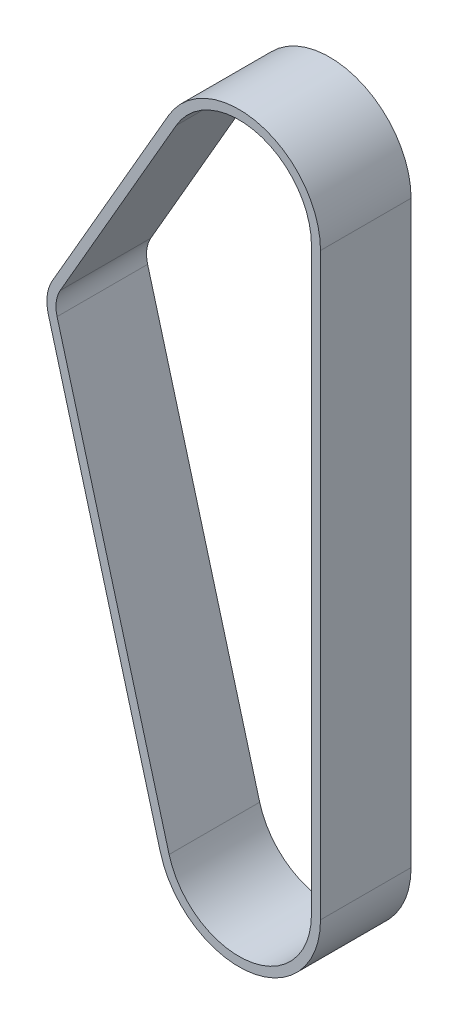
ISO-10303-21;
HEADER;
FILE_DESCRIPTION(('STEP AP214'),'2;1');
FILE_NAME('part.step','',(''),(''),'','','');
FILE_SCHEMA(('AUTOMOTIVE_DESIGN { 1 0 10303 214 1 1 1 1 }'));
ENDSEC;
DATA;
#1=APPLICATION_CONTEXT('core data for automotive mechanical design processes');
#2=APPLICATION_PROTOCOL_DEFINITION('international standard','automotive_design',2000,#1);
#3=PRODUCT_CONTEXT('',#1,'mechanical');
#4=PRODUCT('Part','Part','',(#3));
#5=PRODUCT_RELATED_PRODUCT_CATEGORY('part','',(#4));
#6=PRODUCT_DEFINITION_FORMATION('','',#4);
#7=PRODUCT_DEFINITION_CONTEXT('part definition',#1,'design');
#8=PRODUCT_DEFINITION('design','',#6,#7);
#9=PRODUCT_DEFINITION_SHAPE('','',#8);
#10=(LENGTH_UNIT() NAMED_UNIT(*) SI_UNIT(.MILLI.,.METRE.));
#11=(NAMED_UNIT(*) PLANE_ANGLE_UNIT() SI_UNIT($,.RADIAN.));
#12=(NAMED_UNIT(*) SI_UNIT($,.STERADIAN.) SOLID_ANGLE_UNIT());
#13=UNCERTAINTY_MEASURE_WITH_UNIT(LENGTH_MEASURE(1.E-05),#10,'distance_accuracy_value','');
#14=(GEOMETRIC_REPRESENTATION_CONTEXT(3) GLOBAL_UNCERTAINTY_ASSIGNED_CONTEXT((#13)) GLOBAL_UNIT_ASSIGNED_CONTEXT((#10,
#11,#12)) REPRESENTATION_CONTEXT('',''));
#15=CARTESIAN_POINT('',(0.,0.,0.));
#16=DIRECTION('',(0.,0.,1.));
#17=DIRECTION('',(1.,0.,0.));
#18=AXIS2_PLACEMENT_3D('',#15,#16,#17);
#19=CARTESIAN_POINT('',(3.08780778723872E-13,319.999999999999,50.));
#20=DIRECTION('',(0.,0.,1.));
#21=DIRECTION('',(1.,0.,0.));
#22=AXIS2_PLACEMENT_3D('',#19,#20,#21);
#23=PLANE('',#22);
#24=CARTESIAN_POINT('',(3.08780778723872E-13,319.999999999999,50.));
#25=DIRECTION('',(0.,0.,1.));
#26=DIRECTION('',(1.,0.,0.));
#27=AXIS2_PLACEMENT_3D('',#24,#25,#26);
#28=CIRCLE('',#27,44.9999999999997);
#29=CARTESIAN_POINT('',(45.,319.999999999999,50.));
#30=VERTEX_POINT('',#29);
#31=CARTESIAN_POINT('',(-38.9711431702992,342.499999999999,50.));
#32=VERTEX_POINT('',#31);
#33=EDGE_CURVE('E181',#30,#32,#28,.T.);
#34=ORIENTED_EDGE('',*,*,#33,.T.);
#35=DIRECTION('',(-0.500000000000004,-0.866025403784437,0.));
#36=VECTOR('',#35,1.);
#37=CARTESIAN_POINT('',(-103.03557158515,231.53715502762,50.));
#38=LINE('',#37,#36);
#39=CARTESIAN_POINT('',(-103.03557158515,231.53715502762,50.));
#40=VERTEX_POINT('',#39);
#41=EDGE_CURVE('E184',#32,#40,#38,.T.);
#42=ORIENTED_EDGE('',*,*,#41,.T.);
#43=CARTESIAN_POINT('',(-83.55,220.28715502762,50.));
#44=DIRECTION('',(0.,0.,1.));
#45=DIRECTION('',(1.,0.,0.));
#46=AXIS2_PLACEMENT_3D('',#43,#44,#45);
#47=CIRCLE('',#46,22.5);
#48=CARTESIAN_POINT('',(-105.253530727052,214.353627073703,50.));
#49=VERTEX_POINT('',#48);
#50=EDGE_CURVE('E187',#40,#49,#47,.T.);
#51=ORIENTED_EDGE('',*,*,#50,.T.);
#52=DIRECTION('',(0.263712353507414,-0.964601365646753,0.));
#53=VECTOR('',#52,1.);
#54=CARTESIAN_POINT('',(-105.253530727052,214.353627073703,50.));
#55=LINE('',#54,#53);
#56=CARTESIAN_POINT('',(-43.4070614541039,-11.8670559078336,50.));
#57=VERTEX_POINT('',#56);
#58=EDGE_CURVE('E189',#49,#57,#55,.T.);
#59=ORIENTED_EDGE('',*,*,#58,.T.);
#60=CARTESIAN_POINT('',(0.,0.,50.));
#61=DIRECTION('',(0.,0.,1.));
#62=DIRECTION('',(1.,0.,0.));
#63=AXIS2_PLACEMENT_3D('',#60,#61,#62);
#64=CIRCLE('',#63,45.);
#65=CARTESIAN_POINT('',(45.,0.,50.));
#66=VERTEX_POINT('',#65);
#67=EDGE_CURVE('E191',#57,#66,#64,.T.);
#68=ORIENTED_EDGE('',*,*,#67,.T.);
#69=DIRECTION('',(0.,1.,0.));
#70=VECTOR('',#69,1.);
#71=CARTESIAN_POINT('',(45.,319.999999999999,50.));
#72=LINE('',#71,#70);
#73=EDGE_CURVE('E193',#66,#30,#72,.T.);
#74=ORIENTED_EDGE('',*,*,#73,.T.);
#75=EDGE_LOOP('',(#34,#42,#51,#59,#68,#74));
#76=FACE_BOUND('',#75,.T.);
#77=DIRECTION('',(0.,1.,0.));
#78=VECTOR('',#77,1.);
#79=CARTESIAN_POINT('',(40.,319.999999999999,50.));
#80=LINE('',#79,#78);
#81=CARTESIAN_POINT('',(40.,0.,50.));
#82=VERTEX_POINT('',#81);
#83=CARTESIAN_POINT('',(40.,319.999999999999,50.));
#84=VERTEX_POINT('',#83);
#85=EDGE_CURVE('E138',#82,#84,#80,.T.);
#86=ORIENTED_EDGE('',*,*,#85,.F.);
#87=CARTESIAN_POINT('',(0.,0.,50.));
#88=DIRECTION('',(0.,0.,1.));
#89=DIRECTION('',(1.,0.,0.));
#90=AXIS2_PLACEMENT_3D('',#87,#88,#89);
#91=CIRCLE('',#90,40.);
#92=CARTESIAN_POINT('',(-38.5840546258701,-10.5484941402966,50.));
#93=VERTEX_POINT('',#92);
#94=EDGE_CURVE('E130',#93,#82,#91,.T.);
#95=ORIENTED_EDGE('',*,*,#94,.F.);
#96=DIRECTION('',(0.263712353507414,-0.964601365646753,0.));
#97=VECTOR('',#96,1.);
#98=CARTESIAN_POINT('',(-100.430523898818,215.67218884124,50.));
#99=LINE('',#98,#97);
#100=CARTESIAN_POINT('',(-100.430523898818,215.67218884124,50.));
#101=VERTEX_POINT('',#100);
#102=EDGE_CURVE('E159',#101,#93,#99,.T.);
#103=ORIENTED_EDGE('',*,*,#102,.F.);
#104=CARTESIAN_POINT('',(-83.55,220.28715502762,50.));
#105=DIRECTION('',(0.,0.,1.));
#106=DIRECTION('',(1.,0.,0.));
#107=AXIS2_PLACEMENT_3D('',#104,#105,#106);
#108=CIRCLE('',#107,17.5);
#109=CARTESIAN_POINT('',(-98.7054445662277,229.03715502762,50.));
#110=VERTEX_POINT('',#109);
#111=EDGE_CURVE('E157',#110,#101,#108,.T.);
#112=ORIENTED_EDGE('',*,*,#111,.F.);
#113=DIRECTION('',(-0.500000000000004,-0.866025403784437,0.));
#114=VECTOR('',#113,1.);
#115=CARTESIAN_POINT('',(-98.7054445662277,229.03715502762,50.));
#116=LINE('',#115,#114);
#117=CARTESIAN_POINT('',(-34.641016151377,339.999999999999,50.));
#118=VERTEX_POINT('',#117);
#119=EDGE_CURVE('E153',#118,#110,#116,.T.);
#120=ORIENTED_EDGE('',*,*,#119,.F.);
#121=CARTESIAN_POINT('',(3.08780778723872E-13,319.999999999999,50.));
#122=DIRECTION('',(0.,0.,1.));
#123=DIRECTION('',(1.,0.,0.));
#124=AXIS2_PLACEMENT_3D('',#121,#122,#123);
#125=CIRCLE('',#124,39.9999999999997);
#126=EDGE_CURVE('E151',#84,#118,#125,.T.);
#127=ORIENTED_EDGE('',*,*,#126,.F.);
#128=EDGE_LOOP('',(#86,#95,#103,#112,#120,#127));
#129=FACE_BOUND('',#128,.T.);
#130=ADVANCED_FACE('F41',(#76,#129),#23,.T.);
#131=CARTESIAN_POINT('',(3.08780778723872E-13,319.999999999999,0.));
#132=DIRECTION('',(0.,0.,1.));
#133=DIRECTION('',(1.,0.,0.));
#134=AXIS2_PLACEMENT_3D('',#131,#132,#133);
#135=PLANE('',#134);
#136=CARTESIAN_POINT('',(3.08780778723872E-13,319.999999999999,0.));
#137=DIRECTION('',(0.,0.,1.));
#138=DIRECTION('',(1.,0.,0.));
#139=AXIS2_PLACEMENT_3D('',#136,#137,#138);
#140=CIRCLE('',#139,44.9999999999997);
#141=CARTESIAN_POINT('',(45.,319.999999999999,0.));
#142=VERTEX_POINT('',#141);
#143=CARTESIAN_POINT('',(-38.9711431702992,342.499999999999,0.));
#144=VERTEX_POINT('',#143);
#145=EDGE_CURVE('E146',#142,#144,#140,.T.);
#146=ORIENTED_EDGE('',*,*,#145,.F.);
#147=DIRECTION('',(0.,1.,0.));
#148=VECTOR('',#147,1.);
#149=CARTESIAN_POINT('',(45.,319.999999999999,0.));
#150=LINE('',#149,#148);
#151=CARTESIAN_POINT('',(45.,0.,0.));
#152=VERTEX_POINT('',#151);
#153=EDGE_CURVE('E185',#152,#142,#150,.T.);
#154=ORIENTED_EDGE('',*,*,#153,.F.);
#155=CARTESIAN_POINT('',(0.,0.,0.));
#156=DIRECTION('',(0.,0.,1.));
#157=DIRECTION('',(1.,0.,0.));
#158=AXIS2_PLACEMENT_3D('',#155,#156,#157);
#159=CIRCLE('',#158,45.);
#160=CARTESIAN_POINT('',(-43.4070614541039,-11.8670559078336,0.));
#161=VERTEX_POINT('',#160);
#162=EDGE_CURVE('E204',#161,#152,#159,.T.);
#163=ORIENTED_EDGE('',*,*,#162,.F.);
#164=DIRECTION('',(0.263712353507414,-0.964601365646753,0.));
#165=VECTOR('',#164,1.);
#166=CARTESIAN_POINT('',(-105.253530727052,214.353627073703,0.));
#167=LINE('',#166,#165);
#168=CARTESIAN_POINT('',(-105.253530727052,214.353627073703,0.));
#169=VERTEX_POINT('',#168);
#170=EDGE_CURVE('E202',#169,#161,#167,.T.);
#171=ORIENTED_EDGE('',*,*,#170,.F.);
#172=CARTESIAN_POINT('',(-83.55,220.28715502762,0.));
#173=DIRECTION('',(0.,0.,1.));
#174=DIRECTION('',(1.,0.,0.));
#175=AXIS2_PLACEMENT_3D('',#172,#173,#174);
#176=CIRCLE('',#175,22.5);
#177=CARTESIAN_POINT('',(-103.03557158515,231.53715502762,0.));
#178=VERTEX_POINT('',#177);
#179=EDGE_CURVE('E200',#178,#169,#176,.T.);
#180=ORIENTED_EDGE('',*,*,#179,.F.);
#181=DIRECTION('',(-0.500000000000004,-0.866025403784437,0.));
#182=VECTOR('',#181,1.);
#183=CARTESIAN_POINT('',(-103.03557158515,231.53715502762,0.));
#184=LINE('',#183,#182);
#185=EDGE_CURVE('E198',#144,#178,#184,.T.);
#186=ORIENTED_EDGE('',*,*,#185,.F.);
#187=EDGE_LOOP('',(#146,#154,#163,#171,#180,#186));
#188=FACE_BOUND('',#187,.T.);
#189=CARTESIAN_POINT('',(0.,0.,0.));
#190=DIRECTION('',(0.,0.,1.));
#191=DIRECTION('',(1.,0.,0.));
#192=AXIS2_PLACEMENT_3D('',#189,#190,#191);
#193=CIRCLE('',#192,40.);
#194=CARTESIAN_POINT('',(-38.5840546258701,-10.5484941402965,0.));
#195=VERTEX_POINT('',#194);
#196=CARTESIAN_POINT('',(40.,0.,0.));
#197=VERTEX_POINT('',#196);
#198=EDGE_CURVE('E64',#195,#197,#193,.T.);
#199=ORIENTED_EDGE('',*,*,#198,.T.);
#200=DIRECTION('',(0.,1.,0.));
#201=VECTOR('',#200,1.);
#202=CARTESIAN_POINT('',(40.,319.999999999999,0.));
#203=LINE('',#202,#201);
#204=CARTESIAN_POINT('',(40.,319.999999999999,0.));
#205=VERTEX_POINT('',#204);
#206=EDGE_CURVE('E145',#197,#205,#203,.T.);
#207=ORIENTED_EDGE('',*,*,#206,.T.);
#208=CARTESIAN_POINT('',(3.08780778723872E-13,319.999999999999,0.));
#209=DIRECTION('',(0.,0.,1.));
#210=DIRECTION('',(1.,0.,0.));
#211=AXIS2_PLACEMENT_3D('',#208,#209,#210);
#212=CIRCLE('',#211,39.9999999999997);
#213=CARTESIAN_POINT('',(-34.641016151377,339.999999999999,0.));
#214=VERTEX_POINT('',#213);
#215=EDGE_CURVE('E163',#205,#214,#212,.T.);
#216=ORIENTED_EDGE('',*,*,#215,.T.);
#217=DIRECTION('',(-0.500000000000004,-0.866025403784437,0.));
#218=VECTOR('',#217,1.);
#219=CARTESIAN_POINT('',(-98.7054445662277,229.03715502762,0.));
#220=LINE('',#219,#218);
#221=CARTESIAN_POINT('',(-98.7054445662277,229.03715502762,0.));
#222=VERTEX_POINT('',#221);
#223=EDGE_CURVE('E166',#214,#222,#220,.T.);
#224=ORIENTED_EDGE('',*,*,#223,.T.);
#225=CARTESIAN_POINT('',(-83.55,220.28715502762,0.));
#226=DIRECTION('',(0.,0.,1.));
#227=DIRECTION('',(1.,0.,0.));
#228=AXIS2_PLACEMENT_3D('',#225,#226,#227);
#229=CIRCLE('',#228,17.5);
#230=CARTESIAN_POINT('',(-100.430523898818,215.67218884124,0.));
#231=VERTEX_POINT('',#230);
#232=EDGE_CURVE('E169',#222,#231,#229,.T.);
#233=ORIENTED_EDGE('',*,*,#232,.T.);
#234=DIRECTION('',(0.263712353507414,-0.964601365646753,0.));
#235=VECTOR('',#234,1.);
#236=CARTESIAN_POINT('',(-100.430523898818,215.67218884124,0.));
#237=LINE('',#236,#235);
#238=EDGE_CURVE('E139',#231,#195,#237,.T.);
#239=ORIENTED_EDGE('',*,*,#238,.T.);
#240=EDGE_LOOP('',(#199,#207,#216,#224,#233,#239));
#241=FACE_BOUND('',#240,.T.);
#242=ADVANCED_FACE('F228',(#188,#241),#135,.F.);
#243=CARTESIAN_POINT('',(3.08780778723872E-13,319.999999999999,50.));
#244=DIRECTION('',(0.,0.,-1.));
#245=DIRECTION('',(-1.,0.,0.));
#246=AXIS2_PLACEMENT_3D('',#243,#244,#245);
#247=CYLINDRICAL_SURFACE('',#246,44.9999999999997);
#248=ORIENTED_EDGE('',*,*,#145,.T.);
#249=DIRECTION('',(0.,0.,-1.));
#250=VECTOR('',#249,1.);
#251=CARTESIAN_POINT('',(-38.9711431702992,342.499999999999,50.));
#252=LINE('',#251,#250);
#253=EDGE_CURVE('E11',#32,#144,#252,.T.);
#254=ORIENTED_EDGE('',*,*,#253,.F.);
#255=ORIENTED_EDGE('',*,*,#33,.F.);
#256=DIRECTION('',(0.,0.,-1.));
#257=VECTOR('',#256,1.);
#258=CARTESIAN_POINT('',(45.,319.999999999999,50.));
#259=LINE('',#258,#257);
#260=EDGE_CURVE('E195',#30,#142,#259,.T.);
#261=ORIENTED_EDGE('',*,*,#260,.T.);
#262=EDGE_LOOP('',(#248,#254,#255,#261));
#263=FACE_BOUND('',#262,.T.);
#264=ADVANCED_FACE('F43',(#263),#247,.T.);
#265=CARTESIAN_POINT('',(-103.03557158515,231.53715502762,50.));
#266=DIRECTION('',(0.866025403784437,-0.500000000000004,0.));
#267=DIRECTION('',(0.500000000000004,0.866025403784437,0.));
#268=AXIS2_PLACEMENT_3D('',#265,#266,#267);
#269=PLANE('',#268);
#270=ORIENTED_EDGE('',*,*,#185,.T.);
#271=DIRECTION('',(0.,0.,-1.));
#272=VECTOR('',#271,1.);
#273=CARTESIAN_POINT('',(-103.03557158515,231.53715502762,50.));
#274=LINE('',#273,#272);
#275=EDGE_CURVE('E49',#40,#178,#274,.T.);
#276=ORIENTED_EDGE('',*,*,#275,.F.);
#277=ORIENTED_EDGE('',*,*,#41,.F.);
#278=ORIENTED_EDGE('',*,*,#253,.T.);
#279=EDGE_LOOP('',(#270,#276,#277,#278));
#280=FACE_BOUND('',#279,.T.);
#281=ADVANCED_FACE('F245',(#280),#269,.F.);
#282=CARTESIAN_POINT('',(-83.55,220.28715502762,50.));
#283=DIRECTION('',(0.,0.,-1.));
#284=DIRECTION('',(-1.,0.,0.));
#285=AXIS2_PLACEMENT_3D('',#282,#283,#284);
#286=CYLINDRICAL_SURFACE('',#285,22.5);
#287=ORIENTED_EDGE('',*,*,#179,.T.);
#288=DIRECTION('',(0.,0.,-1.));
#289=VECTOR('',#288,1.);
#290=CARTESIAN_POINT('',(-105.253530727052,214.353627073703,50.));
#291=LINE('',#290,#289);
#292=EDGE_CURVE('E215',#49,#169,#291,.T.);
#293=ORIENTED_EDGE('',*,*,#292,.F.);
#294=ORIENTED_EDGE('',*,*,#50,.F.);
#295=ORIENTED_EDGE('',*,*,#275,.T.);
#296=EDGE_LOOP('',(#287,#293,#294,#295));
#297=FACE_BOUND('',#296,.T.);
#298=ADVANCED_FACE('F222',(#297),#286,.T.);
#299=CARTESIAN_POINT('',(-105.253530727052,214.353627073703,50.));
#300=DIRECTION('',(0.964601365646753,0.263712353507414,0.));
#301=DIRECTION('',(-0.263712353507414,0.964601365646753,0.));
#302=AXIS2_PLACEMENT_3D('',#299,#300,#301);
#303=PLANE('',#302);
#304=ORIENTED_EDGE('',*,*,#170,.T.);
#305=DIRECTION('',(0.,0.,-1.));
#306=VECTOR('',#305,1.);
#307=CARTESIAN_POINT('',(-43.4070614541039,-11.8670559078336,50.));
#308=LINE('',#307,#306);
#309=EDGE_CURVE('E212',#57,#161,#308,.T.);
#310=ORIENTED_EDGE('',*,*,#309,.F.);
#311=ORIENTED_EDGE('',*,*,#58,.F.);
#312=ORIENTED_EDGE('',*,*,#292,.T.);
#313=EDGE_LOOP('',(#304,#310,#311,#312));
#314=FACE_BOUND('',#313,.T.);
#315=ADVANCED_FACE('F234',(#314),#303,.F.);
#316=CARTESIAN_POINT('',(0.,0.,50.));
#317=DIRECTION('',(0.,0.,-1.));
#318=DIRECTION('',(-1.,0.,0.));
#319=AXIS2_PLACEMENT_3D('',#316,#317,#318);
#320=CYLINDRICAL_SURFACE('',#319,45.);
#321=ORIENTED_EDGE('',*,*,#162,.T.);
#322=DIRECTION('',(0.,0.,-1.));
#323=VECTOR('',#322,1.);
#324=CARTESIAN_POINT('',(45.,0.,50.));
#325=LINE('',#324,#323);
#326=EDGE_CURVE('E209',#66,#152,#325,.T.);
#327=ORIENTED_EDGE('',*,*,#326,.F.);
#328=ORIENTED_EDGE('',*,*,#67,.F.);
#329=ORIENTED_EDGE('',*,*,#309,.T.);
#330=EDGE_LOOP('',(#321,#327,#328,#329));
#331=FACE_BOUND('',#330,.T.);
#332=ADVANCED_FACE('F238',(#331),#320,.T.);
#333=CARTESIAN_POINT('',(45.,319.999999999999,50.));
#334=DIRECTION('',(-1.,0.,0.));
#335=DIRECTION('',(0.,0.,1.));
#336=AXIS2_PLACEMENT_3D('',#333,#334,#335);
#337=PLANE('',#336);
#338=ORIENTED_EDGE('',*,*,#153,.T.);
#339=ORIENTED_EDGE('',*,*,#260,.F.);
#340=ORIENTED_EDGE('',*,*,#73,.F.);
#341=ORIENTED_EDGE('',*,*,#326,.T.);
#342=EDGE_LOOP('',(#338,#339,#340,#341));
#343=FACE_BOUND('',#342,.T.);
#344=ADVANCED_FACE('F248',(#343),#337,.F.);
#345=CARTESIAN_POINT('',(0.,0.,50.));
#346=DIRECTION('',(0.,0.,-1.));
#347=DIRECTION('',(-1.,0.,0.));
#348=AXIS2_PLACEMENT_3D('',#345,#346,#347);
#349=CYLINDRICAL_SURFACE('',#348,40.);
#350=ORIENTED_EDGE('',*,*,#198,.F.);
#351=DIRECTION('',(0.,0.,-1.));
#352=VECTOR('',#351,1.);
#353=CARTESIAN_POINT('',(-38.5840546258701,-10.5484941402966,50.));
#354=LINE('',#353,#352);
#355=EDGE_CURVE('E134',#93,#195,#354,.T.);
#356=ORIENTED_EDGE('',*,*,#355,.F.);
#357=ORIENTED_EDGE('',*,*,#94,.T.);
#358=DIRECTION('',(0.,0.,-1.));
#359=VECTOR('',#358,1.);
#360=CARTESIAN_POINT('',(40.,0.,50.));
#361=LINE('',#360,#359);
#362=EDGE_CURVE('E133',#82,#197,#361,.T.);
#363=ORIENTED_EDGE('',*,*,#362,.T.);
#364=EDGE_LOOP('',(#350,#356,#357,#363));
#365=FACE_BOUND('',#364,.T.);
#366=ADVANCED_FACE('F132',(#365),#349,.F.);
#367=CARTESIAN_POINT('',(40.,319.999999999999,50.));
#368=DIRECTION('',(-1.,0.,0.));
#369=DIRECTION('',(0.,-1.,0.));
#370=AXIS2_PLACEMENT_3D('',#367,#368,#369);
#371=PLANE('',#370);
#372=ORIENTED_EDGE('',*,*,#206,.F.);
#373=ORIENTED_EDGE('',*,*,#362,.F.);
#374=ORIENTED_EDGE('',*,*,#85,.T.);
#375=DIRECTION('',(0.,0.,-1.));
#376=VECTOR('',#375,1.);
#377=CARTESIAN_POINT('',(40.,319.999999999999,50.));
#378=LINE('',#377,#376);
#379=EDGE_CURVE('E147',#84,#205,#378,.T.);
#380=ORIENTED_EDGE('',*,*,#379,.T.);
#381=EDGE_LOOP('',(#372,#373,#374,#380));
#382=FACE_BOUND('',#381,.T.);
#383=ADVANCED_FACE('F142',(#382),#371,.T.);
#384=CARTESIAN_POINT('',(3.08780778723872E-13,319.999999999999,50.));
#385=DIRECTION('',(0.,0.,-1.));
#386=DIRECTION('',(-1.,0.,0.));
#387=AXIS2_PLACEMENT_3D('',#384,#385,#386);
#388=CYLINDRICAL_SURFACE('',#387,39.9999999999997);
#389=ORIENTED_EDGE('',*,*,#215,.F.);
#390=ORIENTED_EDGE('',*,*,#379,.F.);
#391=ORIENTED_EDGE('',*,*,#126,.T.);
#392=DIRECTION('',(0.,0.,-1.));
#393=VECTOR('',#392,1.);
#394=CARTESIAN_POINT('',(-34.641016151377,339.999999999999,50.));
#395=LINE('',#394,#393);
#396=EDGE_CURVE('E178',#118,#214,#395,.T.);
#397=ORIENTED_EDGE('',*,*,#396,.T.);
#398=EDGE_LOOP('',(#389,#390,#391,#397));
#399=FACE_BOUND('',#398,.T.);
#400=ADVANCED_FACE('F266',(#399),#388,.F.);
#401=CARTESIAN_POINT('',(-98.7054445662277,229.03715502762,50.));
#402=DIRECTION('',(0.866025403784437,-0.500000000000004,0.));
#403=DIRECTION('',(0.500000000000004,0.866025403784437,0.));
#404=AXIS2_PLACEMENT_3D('',#401,#402,#403);
#405=PLANE('',#404);
#406=ORIENTED_EDGE('',*,*,#223,.F.);
#407=ORIENTED_EDGE('',*,*,#396,.F.);
#408=ORIENTED_EDGE('',*,*,#119,.T.);
#409=DIRECTION('',(0.,0.,-1.));
#410=VECTOR('',#409,1.);
#411=CARTESIAN_POINT('',(-98.7054445662277,229.03715502762,50.));
#412=LINE('',#411,#410);
#413=EDGE_CURVE('E176',#110,#222,#412,.T.);
#414=ORIENTED_EDGE('',*,*,#413,.T.);
#415=EDGE_LOOP('',(#406,#407,#408,#414));
#416=FACE_BOUND('',#415,.T.);
#417=ADVANCED_FACE('F269',(#416),#405,.T.);
#418=CARTESIAN_POINT('',(-83.55,220.28715502762,50.));
#419=DIRECTION('',(0.,0.,-1.));
#420=DIRECTION('',(-1.,0.,0.));
#421=AXIS2_PLACEMENT_3D('',#418,#419,#420);
#422=CYLINDRICAL_SURFACE('',#421,17.5);
#423=ORIENTED_EDGE('',*,*,#232,.F.);
#424=ORIENTED_EDGE('',*,*,#413,.F.);
#425=ORIENTED_EDGE('',*,*,#111,.T.);
#426=DIRECTION('',(0.,0.,-1.));
#427=VECTOR('',#426,1.);
#428=CARTESIAN_POINT('',(-100.430523898818,215.67218884124,50.));
#429=LINE('',#428,#427);
#430=EDGE_CURVE('E56',#101,#231,#429,.T.);
#431=ORIENTED_EDGE('',*,*,#430,.T.);
#432=EDGE_LOOP('',(#423,#424,#425,#431));
#433=FACE_BOUND('',#432,.T.);
#434=ADVANCED_FACE('F273',(#433),#422,.F.);
#435=CARTESIAN_POINT('',(-100.430523898818,215.67218884124,50.));
#436=DIRECTION('',(0.964601365646753,0.263712353507414,0.));
#437=DIRECTION('',(-0.263712353507414,0.964601365646753,0.));
#438=AXIS2_PLACEMENT_3D('',#435,#436,#437);
#439=PLANE('',#438);
#440=ORIENTED_EDGE('',*,*,#238,.F.);
#441=ORIENTED_EDGE('',*,*,#430,.F.);
#442=ORIENTED_EDGE('',*,*,#102,.T.);
#443=ORIENTED_EDGE('',*,*,#355,.T.);
#444=EDGE_LOOP('',(#440,#441,#442,#443));
#445=FACE_BOUND('',#444,.T.);
#446=ADVANCED_FACE('F277',(#445),#439,.T.);
#447=CLOSED_SHELL('',(#130,#242,#264,#281,#298,#315,#332,#344,#366,#383,#400,#417,#434,#446));
#448=MANIFOLD_SOLID_BREP('B2',#447);
#449=ADVANCED_BREP_SHAPE_REPRESENTATION('',(#18,#448),#14);
#450=SHAPE_DEFINITION_REPRESENTATION(#9,#449);
ENDSEC;
END-ISO-10303-21;
